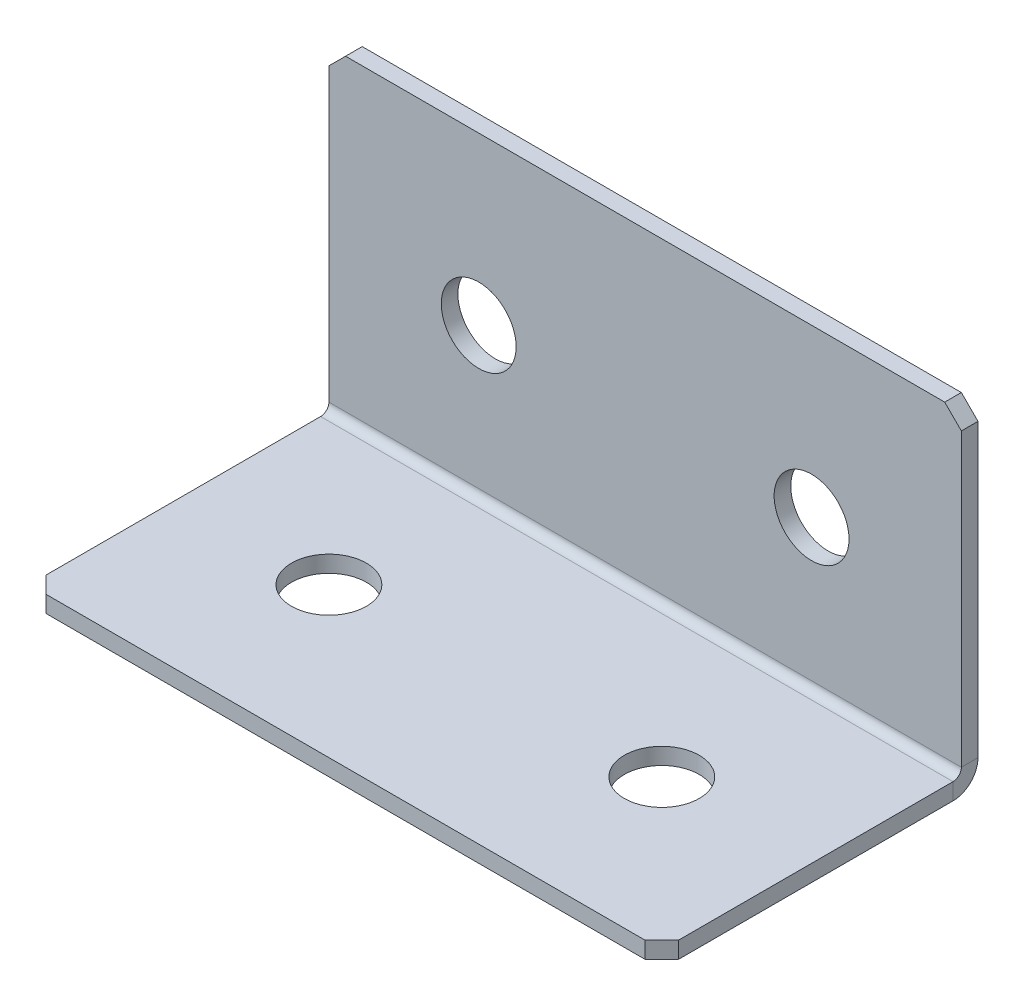
ISO-10303-21;
HEADER;
FILE_DESCRIPTION(('STEP AP214'),'2;1');
FILE_NAME('part.step','',(''),(''),'','','');
FILE_SCHEMA(('AUTOMOTIVE_DESIGN { 1 0 10303 214 1 1 1 1 }'));
ENDSEC;
DATA;
#1=APPLICATION_CONTEXT('core data for automotive mechanical design processes');
#2=APPLICATION_PROTOCOL_DEFINITION('international standard','automotive_design',2000,#1);
#3=PRODUCT_CONTEXT('',#1,'mechanical');
#4=PRODUCT('Part','Part','',(#3));
#5=PRODUCT_RELATED_PRODUCT_CATEGORY('part','',(#4));
#6=PRODUCT_DEFINITION_FORMATION('','',#4);
#7=PRODUCT_DEFINITION_CONTEXT('part definition',#1,'design');
#8=PRODUCT_DEFINITION('design','',#6,#7);
#9=PRODUCT_DEFINITION_SHAPE('','',#8);
#10=(LENGTH_UNIT() NAMED_UNIT(*) SI_UNIT(.MILLI.,.METRE.));
#11=(NAMED_UNIT(*) PLANE_ANGLE_UNIT() SI_UNIT($,.RADIAN.));
#12=(NAMED_UNIT(*) SI_UNIT($,.STERADIAN.) SOLID_ANGLE_UNIT());
#13=UNCERTAINTY_MEASURE_WITH_UNIT(LENGTH_MEASURE(1.E-05),#10,'distance_accuracy_value','');
#14=(GEOMETRIC_REPRESENTATION_CONTEXT(3) GLOBAL_UNCERTAINTY_ASSIGNED_CONTEXT((#13)) GLOBAL_UNIT_ASSIGNED_CONTEXT((#10,
#11,#12)) REPRESENTATION_CONTEXT('',''));
#15=CARTESIAN_POINT('',(0.,0.,0.));
#16=DIRECTION('',(0.,0.,1.));
#17=DIRECTION('',(1.,0.,0.));
#18=AXIS2_PLACEMENT_3D('',#15,#16,#17);
#19=CARTESIAN_POINT('',(0.,0.,2.));
#20=DIRECTION('',(0.,0.,-1.));
#21=DIRECTION('',(-1.,0.,0.));
#22=AXIS2_PLACEMENT_3D('',#19,#20,#21);
#23=PLANE('',#22);
#24=DIRECTION('',(0.,1.,0.));
#25=VECTOR('',#24,1.);
#26=CARTESIAN_POINT('',(38.,0.,2.));
#27=LINE('',#26,#25);
#28=CARTESIAN_POINT('',(38.,3.,2.));
#29=VERTEX_POINT('',#28);
#30=CARTESIAN_POINT('',(38.,38.,2.));
#31=VERTEX_POINT('',#30);
#32=EDGE_CURVE('E254',#29,#31,#27,.T.);
#33=ORIENTED_EDGE('',*,*,#32,.T.);
#34=DIRECTION('',(0.707106781186548,-0.707106781186548,0.));
#35=VECTOR('',#34,1.);
#36=CARTESIAN_POINT('',(38.,38.,2.));
#37=LINE('',#36,#35);
#38=CARTESIAN_POINT('',(36.,40.,2.));
#39=VERTEX_POINT('',#38);
#40=EDGE_CURVE('E303',#31,#39,#37,.F.);
#41=ORIENTED_EDGE('',*,*,#40,.T.);
#42=DIRECTION('',(-1.,0.,0.));
#43=VECTOR('',#42,1.);
#44=CARTESIAN_POINT('',(-38.,40.,2.));
#45=LINE('',#44,#43);
#46=CARTESIAN_POINT('',(-36.,40.,2.));
#47=VERTEX_POINT('',#46);
#48=EDGE_CURVE('E259',#39,#47,#45,.T.);
#49=ORIENTED_EDGE('',*,*,#48,.T.);
#50=DIRECTION('',(0.707106781186548,0.707106781186548,0.));
#51=VECTOR('',#50,1.);
#52=CARTESIAN_POINT('',(-36.,40.,2.));
#53=LINE('',#52,#51);
#54=CARTESIAN_POINT('',(-38.,38.,2.));
#55=VERTEX_POINT('',#54);
#56=EDGE_CURVE('E300',#47,#55,#53,.F.);
#57=ORIENTED_EDGE('',*,*,#56,.T.);
#58=DIRECTION('',(0.,-1.,0.));
#59=VECTOR('',#58,1.);
#60=CARTESIAN_POINT('',(-38.,0.,2.));
#61=LINE('',#60,#59);
#62=CARTESIAN_POINT('',(-38.,3.,2.));
#63=VERTEX_POINT('',#62);
#64=EDGE_CURVE('E251',#55,#63,#61,.T.);
#65=ORIENTED_EDGE('',*,*,#64,.T.);
#66=DIRECTION('',(1.,0.,0.));
#67=VECTOR('',#66,1.);
#68=CARTESIAN_POINT('',(38.,3.,2.));
#69=LINE('',#68,#67);
#70=EDGE_CURVE('E238',#29,#63,#69,.F.);
#71=ORIENTED_EDGE('',*,*,#70,.F.);
#72=EDGE_LOOP('',(#33,#41,#49,#57,#65,#71));
#73=FACE_BOUND('',#72,.T.);
#74=CARTESIAN_POINT('',(20.,19.9999999999999,2.));
#75=DIRECTION('',(0.,0.,1.));
#76=DIRECTION('',(1.,0.,0.));
#77=AXIS2_PLACEMENT_3D('',#74,#75,#76);
#78=CIRCLE('',#77,4.5);
#79=CARTESIAN_POINT('',(24.5,19.9999999999999,2.));
#80=VERTEX_POINT('',#79);
#81=EDGE_CURVE('E684',#80,#80,#78,.T.);
#82=ORIENTED_EDGE('',*,*,#81,.F.);
#83=EDGE_LOOP('',(#82));
#84=FACE_BOUND('',#83,.T.);
#85=CARTESIAN_POINT('',(-20.,19.9999999999999,2.));
#86=DIRECTION('',(0.,0.,1.));
#87=DIRECTION('',(1.,0.,0.));
#88=AXIS2_PLACEMENT_3D('',#85,#86,#87);
#89=CIRCLE('',#88,4.5);
#90=CARTESIAN_POINT('',(-15.5,19.9999999999999,2.));
#91=VERTEX_POINT('',#90);
#92=EDGE_CURVE('E666',#91,#91,#89,.T.);
#93=ORIENTED_EDGE('',*,*,#92,.F.);
#94=EDGE_LOOP('',(#93));
#95=FACE_BOUND('',#94,.T.);
#96=ADVANCED_FACE('F70',(#73,#84,#95),#23,.F.);
#97=CARTESIAN_POINT('',(38.,0.,2.));
#98=DIRECTION('',(-1.,0.,0.));
#99=DIRECTION('',(0.,1.,0.));
#100=AXIS2_PLACEMENT_3D('',#97,#98,#99);
#101=PLANE('',#100);
#102=DIRECTION('',(0.,1.,0.));
#103=VECTOR('',#102,1.);
#104=CARTESIAN_POINT('',(38.,0.,0.));
#105=LINE('',#104,#103);
#106=CARTESIAN_POINT('',(38.,3.,0.));
#107=VERTEX_POINT('',#106);
#108=CARTESIAN_POINT('',(38.,38.,0.));
#109=VERTEX_POINT('',#108);
#110=EDGE_CURVE('E266',#107,#109,#105,.T.);
#111=ORIENTED_EDGE('',*,*,#110,.T.);
#112=DIRECTION('',(0.,0.,-1.));
#113=VECTOR('',#112,1.);
#114=CARTESIAN_POINT('',(38.,38.,2.));
#115=LINE('',#114,#113);
#116=EDGE_CURVE('E296',#109,#31,#115,.F.);
#117=ORIENTED_EDGE('',*,*,#116,.T.);
#118=ORIENTED_EDGE('',*,*,#32,.F.);
#119=DIRECTION('',(0.,0.,-1.));
#120=VECTOR('',#119,1.);
#121=CARTESIAN_POINT('',(38.,3.,2.));
#122=LINE('',#121,#120);
#123=EDGE_CURVE('E233',#29,#107,#122,.T.);
#124=ORIENTED_EDGE('',*,*,#123,.T.);
#125=EDGE_LOOP('',(#111,#117,#118,#124));
#126=FACE_BOUND('',#125,.T.);
#127=ADVANCED_FACE('F324',(#126),#101,.F.);
#128=CARTESIAN_POINT('',(0.,0.,0.));
#129=DIRECTION('',(0.,0.,-1.));
#130=DIRECTION('',(-1.,0.,0.));
#131=AXIS2_PLACEMENT_3D('',#128,#129,#130);
#132=PLANE('',#131);
#133=CARTESIAN_POINT('',(-20.,19.9999999999999,0.));
#134=DIRECTION('',(0.,0.,-1.));
#135=DIRECTION('',(-1.,0.,0.));
#136=AXIS2_PLACEMENT_3D('',#133,#134,#135);
#137=CIRCLE('',#136,4.5);
#138=CARTESIAN_POINT('',(-24.5,19.9999999999999,0.));
#139=VERTEX_POINT('',#138);
#140=EDGE_CURVE('E675',#139,#139,#137,.T.);
#141=ORIENTED_EDGE('',*,*,#140,.F.);
#142=EDGE_LOOP('',(#141));
#143=FACE_BOUND('',#142,.T.);
#144=CARTESIAN_POINT('',(20.,19.9999999999999,0.));
#145=DIRECTION('',(0.,0.,-1.));
#146=DIRECTION('',(-1.,0.,0.));
#147=AXIS2_PLACEMENT_3D('',#144,#145,#146);
#148=CIRCLE('',#147,4.5);
#149=CARTESIAN_POINT('',(15.5,19.9999999999999,0.));
#150=VERTEX_POINT('',#149);
#151=EDGE_CURVE('E228',#150,#150,#148,.T.);
#152=ORIENTED_EDGE('',*,*,#151,.F.);
#153=EDGE_LOOP('',(#152));
#154=FACE_BOUND('',#153,.T.);
#155=DIRECTION('',(-1.,0.,0.));
#156=VECTOR('',#155,1.);
#157=CARTESIAN_POINT('',(0.,40.,0.));
#158=LINE('',#157,#156);
#159=CARTESIAN_POINT('',(36.,40.,0.));
#160=VERTEX_POINT('',#159);
#161=CARTESIAN_POINT('',(-36.,40.,0.));
#162=VERTEX_POINT('',#161);
#163=EDGE_CURVE('E255',#160,#162,#158,.T.);
#164=ORIENTED_EDGE('',*,*,#163,.F.);
#165=DIRECTION('',(-0.707106781186548,0.707106781186548,0.));
#166=VECTOR('',#165,1.);
#167=CARTESIAN_POINT('',(38.,38.,0.));
#168=LINE('',#167,#166);
#169=EDGE_CURVE('E80',#160,#109,#168,.F.);
#170=ORIENTED_EDGE('',*,*,#169,.T.);
#171=ORIENTED_EDGE('',*,*,#110,.F.);
#172=DIRECTION('',(1.,0.,0.));
#173=VECTOR('',#172,1.);
#174=CARTESIAN_POINT('',(38.,3.,0.));
#175=LINE('',#174,#173);
#176=CARTESIAN_POINT('',(-38.,3.00000000000001,0.));
#177=VERTEX_POINT('',#176);
#178=EDGE_CURVE('E169',#107,#177,#175,.F.);
#179=ORIENTED_EDGE('',*,*,#178,.T.);
#180=DIRECTION('',(0.,1.,0.));
#181=VECTOR('',#180,1.);
#182=CARTESIAN_POINT('',(-38.,0.,0.));
#183=LINE('',#182,#181);
#184=CARTESIAN_POINT('',(-38.,38.,0.));
#185=VERTEX_POINT('',#184);
#186=EDGE_CURVE('E248',#185,#177,#183,.F.);
#187=ORIENTED_EDGE('',*,*,#186,.F.);
#188=DIRECTION('',(-0.707106781186548,-0.707106781186548,0.));
#189=VECTOR('',#188,1.);
#190=CARTESIAN_POINT('',(-38.,38.,0.));
#191=LINE('',#190,#189);
#192=EDGE_CURVE('E92',#185,#162,#191,.F.);
#193=ORIENTED_EDGE('',*,*,#192,.T.);
#194=EDGE_LOOP('',(#164,#170,#171,#179,#187,#193));
#195=FACE_BOUND('',#194,.T.);
#196=ADVANCED_FACE('F319',(#143,#154,#195),#132,.T.);
#197=CARTESIAN_POINT('',(-38.,40.,2.));
#198=DIRECTION('',(0.,-1.,0.));
#199=DIRECTION('',(-1.,0.,0.));
#200=AXIS2_PLACEMENT_3D('',#197,#198,#199);
#201=PLANE('',#200);
#202=ORIENTED_EDGE('',*,*,#48,.F.);
#203=DIRECTION('',(0.,0.,1.));
#204=VECTOR('',#203,1.);
#205=CARTESIAN_POINT('',(36.,40.,2.));
#206=LINE('',#205,#204);
#207=EDGE_CURVE('E310',#39,#160,#206,.F.);
#208=ORIENTED_EDGE('',*,*,#207,.T.);
#209=ORIENTED_EDGE('',*,*,#163,.T.);
#210=DIRECTION('',(0.,0.,-1.));
#211=VECTOR('',#210,1.);
#212=CARTESIAN_POINT('',(-36.,40.,2.));
#213=LINE('',#212,#211);
#214=EDGE_CURVE('E306',#162,#47,#213,.F.);
#215=ORIENTED_EDGE('',*,*,#214,.T.);
#216=EDGE_LOOP('',(#202,#208,#209,#215));
#217=FACE_BOUND('',#216,.T.);
#218=ADVANCED_FACE('F332',(#217),#201,.F.);
#219=CARTESIAN_POINT('',(-38.,0.,2.));
#220=DIRECTION('',(1.,0.,0.));
#221=DIRECTION('',(0.,-1.,0.));
#222=AXIS2_PLACEMENT_3D('',#219,#220,#221);
#223=PLANE('',#222);
#224=ORIENTED_EDGE('',*,*,#64,.F.);
#225=DIRECTION('',(0.,0.,1.));
#226=VECTOR('',#225,1.);
#227=CARTESIAN_POINT('',(-38.,38.,2.));
#228=LINE('',#227,#226);
#229=EDGE_CURVE('E13',#55,#185,#228,.F.);
#230=ORIENTED_EDGE('',*,*,#229,.T.);
#231=ORIENTED_EDGE('',*,*,#186,.T.);
#232=DIRECTION('',(0.,0.,-1.));
#233=VECTOR('',#232,1.);
#234=CARTESIAN_POINT('',(-38.,3.,2.));
#235=LINE('',#234,#233);
#236=EDGE_CURVE('E244',#63,#177,#235,.T.);
#237=ORIENTED_EDGE('',*,*,#236,.F.);
#238=EDGE_LOOP('',(#224,#230,#231,#237));
#239=FACE_BOUND('',#238,.T.);
#240=ADVANCED_FACE('F336',(#239),#223,.F.);
#241=CARTESIAN_POINT('',(-38.,3.,3.));
#242=DIRECTION('',(-1.,0.,0.));
#243=DIRECTION('',(0.,0.,1.));
#244=AXIS2_PLACEMENT_3D('',#241,#242,#243);
#245=PLANE('',#244);
#246=DIRECTION('',(0.,1.,0.));
#247=VECTOR('',#246,1.);
#248=CARTESIAN_POINT('',(-38.,0.,2.99999999999999));
#249=LINE('',#248,#247);
#250=CARTESIAN_POINT('',(-38.,2.,3.));
#251=VERTEX_POINT('',#250);
#252=CARTESIAN_POINT('',(-38.,0.,2.99999999999999));
#253=VERTEX_POINT('',#252);
#254=EDGE_CURVE('E224',#251,#253,#249,.F.);
#255=ORIENTED_EDGE('',*,*,#254,.F.);
#256=CARTESIAN_POINT('',(-38.,3.,3.));
#257=DIRECTION('',(1.,0.,0.));
#258=DIRECTION('',(0.,0.,-1.));
#259=AXIS2_PLACEMENT_3D('',#256,#257,#258);
#260=CIRCLE('',#259,1.);
#261=EDGE_CURVE('E173',#63,#251,#260,.F.);
#262=ORIENTED_EDGE('',*,*,#261,.F.);
#263=ORIENTED_EDGE('',*,*,#236,.T.);
#264=CARTESIAN_POINT('',(-38.,3.,3.));
#265=DIRECTION('',(1.,0.,0.));
#266=DIRECTION('',(0.,0.,-1.));
#267=AXIS2_PLACEMENT_3D('',#264,#265,#266);
#268=CIRCLE('',#267,3.);
#269=EDGE_CURVE('E231',#177,#253,#268,.F.);
#270=ORIENTED_EDGE('',*,*,#269,.T.);
#271=EDGE_LOOP('',(#255,#262,#263,#270));
#272=FACE_BOUND('',#271,.T.);
#273=ADVANCED_FACE('F340',(#272),#245,.T.);
#274=CARTESIAN_POINT('',(38.,3.,3.));
#275=DIRECTION('',(-1.,0.,0.));
#276=DIRECTION('',(0.,0.,1.));
#277=AXIS2_PLACEMENT_3D('',#274,#275,#276);
#278=PLANE('',#277);
#279=CARTESIAN_POINT('',(38.,3.,3.));
#280=DIRECTION('',(1.,0.,0.));
#281=DIRECTION('',(0.,0.,-1.));
#282=AXIS2_PLACEMENT_3D('',#279,#280,#281);
#283=CIRCLE('',#282,1.);
#284=CARTESIAN_POINT('',(38.,2.,3.));
#285=VERTEX_POINT('',#284);
#286=EDGE_CURVE('E180',#285,#29,#283,.T.);
#287=ORIENTED_EDGE('',*,*,#286,.F.);
#288=DIRECTION('',(0.,1.,0.));
#289=VECTOR('',#288,1.);
#290=CARTESIAN_POINT('',(38.,2.,3.));
#291=LINE('',#290,#289);
#292=CARTESIAN_POINT('',(38.,0.,2.99999999999999));
#293=VERTEX_POINT('',#292);
#294=EDGE_CURVE('E177',#285,#293,#291,.F.);
#295=ORIENTED_EDGE('',*,*,#294,.T.);
#296=CARTESIAN_POINT('',(38.,3.,3.));
#297=DIRECTION('',(1.,0.,0.));
#298=DIRECTION('',(0.,0.,-1.));
#299=AXIS2_PLACEMENT_3D('',#296,#297,#298);
#300=CIRCLE('',#299,3.);
#301=EDGE_CURVE('E161',#293,#107,#300,.T.);
#302=ORIENTED_EDGE('',*,*,#301,.T.);
#303=ORIENTED_EDGE('',*,*,#123,.F.);
#304=EDGE_LOOP('',(#287,#295,#302,#303));
#305=FACE_BOUND('',#304,.T.);
#306=ADVANCED_FACE('F178',(#305),#278,.F.);
#307=CARTESIAN_POINT('',(38.,3.,3.));
#308=DIRECTION('',(1.,0.,0.));
#309=DIRECTION('',(0.,-1.,0.));
#310=AXIS2_PLACEMENT_3D('',#307,#308,#309);
#311=CYLINDRICAL_SURFACE('',#310,3.);
#312=ORIENTED_EDGE('',*,*,#178,.F.);
#313=ORIENTED_EDGE('',*,*,#301,.F.);
#314=DIRECTION('',(1.,0.,0.));
#315=VECTOR('',#314,1.);
#316=CARTESIAN_POINT('',(-38.,0.,2.99999999999999));
#317=LINE('',#316,#315);
#318=EDGE_CURVE('E166',#293,#253,#317,.F.);
#319=ORIENTED_EDGE('',*,*,#318,.T.);
#320=ORIENTED_EDGE('',*,*,#269,.F.);
#321=EDGE_LOOP('',(#312,#313,#319,#320));
#322=FACE_BOUND('',#321,.T.);
#323=ADVANCED_FACE('F163',(#322),#311,.T.);
#324=CARTESIAN_POINT('',(38.,3.,3.));
#325=DIRECTION('',(1.,0.,0.));
#326=DIRECTION('',(0.,-1.,0.));
#327=AXIS2_PLACEMENT_3D('',#324,#325,#326);
#328=CYLINDRICAL_SURFACE('',#327,1.);
#329=ORIENTED_EDGE('',*,*,#70,.T.);
#330=ORIENTED_EDGE('',*,*,#261,.T.);
#331=DIRECTION('',(1.,0.,0.));
#332=VECTOR('',#331,1.);
#333=CARTESIAN_POINT('',(-38.,2.,3.));
#334=LINE('',#333,#332);
#335=EDGE_CURVE('E186',#251,#285,#334,.T.);
#336=ORIENTED_EDGE('',*,*,#335,.T.);
#337=ORIENTED_EDGE('',*,*,#286,.T.);
#338=EDGE_LOOP('',(#329,#330,#336,#337));
#339=FACE_BOUND('',#338,.T.);
#340=ADVANCED_FACE('F343',(#339),#328,.F.);
#341=CARTESIAN_POINT('',(-38.,0.,1.99999999999999));
#342=DIRECTION('',(1.,0.,0.));
#343=DIRECTION('',(0.,0.,-1.));
#344=AXIS2_PLACEMENT_3D('',#341,#342,#343);
#345=PLANE('',#344);
#346=DIRECTION('',(0.,0.,-1.));
#347=VECTOR('',#346,1.);
#348=CARTESIAN_POINT('',(-38.,0.,0.));
#349=LINE('',#348,#347);
#350=CARTESIAN_POINT('',(-38.,-1.18754434294446E-13,36.));
#351=VERTEX_POINT('',#350);
#352=EDGE_CURVE('E194',#351,#253,#349,.T.);
#353=ORIENTED_EDGE('',*,*,#352,.F.);
#354=DIRECTION('',(0.,1.,0.));
#355=VECTOR('',#354,1.);
#356=CARTESIAN_POINT('',(-38.,-1.18710365520667E-13,36.));
#357=LINE('',#356,#355);
#358=CARTESIAN_POINT('',(-38.,1.99999999999988,36.));
#359=VERTEX_POINT('',#358);
#360=EDGE_CURVE('E292',#351,#359,#357,.T.);
#361=ORIENTED_EDGE('',*,*,#360,.T.);
#362=DIRECTION('',(0.,0.,1.));
#363=VECTOR('',#362,1.);
#364=CARTESIAN_POINT('',(-38.,2.,2.));
#365=LINE('',#364,#363);
#366=EDGE_CURVE('E196',#359,#251,#365,.F.);
#367=ORIENTED_EDGE('',*,*,#366,.T.);
#368=ORIENTED_EDGE('',*,*,#254,.T.);
#369=EDGE_LOOP('',(#353,#361,#367,#368));
#370=FACE_BOUND('',#369,.T.);
#371=ADVANCED_FACE('F360',(#370),#345,.F.);
#372=CARTESIAN_POINT('',(38.,-1.25767452008319E-13,38.));
#373=DIRECTION('',(-1.,0.,0.));
#374=DIRECTION('',(0.,0.,1.));
#375=AXIS2_PLACEMENT_3D('',#372,#373,#374);
#376=PLANE('',#375);
#377=DIRECTION('',(0.,0.,-1.));
#378=VECTOR('',#377,1.);
#379=CARTESIAN_POINT('',(38.,1.99999999999987,38.));
#380=LINE('',#379,#378);
#381=CARTESIAN_POINT('',(38.,1.99999999999988,36.));
#382=VERTEX_POINT('',#381);
#383=EDGE_CURVE('E217',#285,#382,#380,.F.);
#384=ORIENTED_EDGE('',*,*,#383,.T.);
#385=DIRECTION('',(0.,-1.,0.));
#386=VECTOR('',#385,1.);
#387=CARTESIAN_POINT('',(38.,-1.18784489330632E-13,36.));
#388=LINE('',#387,#386);
#389=CARTESIAN_POINT('',(38.,-1.18754434294446E-13,36.));
#390=VERTEX_POINT('',#389);
#391=EDGE_CURVE('E200',#382,#390,#388,.T.);
#392=ORIENTED_EDGE('',*,*,#391,.T.);
#393=DIRECTION('',(0.,0.,1.));
#394=VECTOR('',#393,1.);
#395=CARTESIAN_POINT('',(38.,0.,0.));
#396=LINE('',#395,#394);
#397=EDGE_CURVE('E191',#293,#390,#396,.T.);
#398=ORIENTED_EDGE('',*,*,#397,.F.);
#399=ORIENTED_EDGE('',*,*,#294,.F.);
#400=EDGE_LOOP('',(#384,#392,#398,#399));
#401=FACE_BOUND('',#400,.T.);
#402=ADVANCED_FACE('F198',(#401),#376,.F.);
#403=CARTESIAN_POINT('',(0.,0.,0.));
#404=DIRECTION('',(0.,1.,0.));
#405=DIRECTION('',(0.,0.,1.));
#406=AXIS2_PLACEMENT_3D('',#403,#404,#405);
#407=PLANE('',#406);
#408=CARTESIAN_POINT('',(-20.,0.,20.));
#409=DIRECTION('',(0.,1.,0.));
#410=DIRECTION('',(0.,0.,1.));
#411=AXIS2_PLACEMENT_3D('',#408,#409,#410);
#412=CIRCLE('',#411,4.5);
#413=CARTESIAN_POINT('',(-20.,0.,24.5));
#414=VERTEX_POINT('',#413);
#415=EDGE_CURVE('E661',#414,#414,#412,.T.);
#416=ORIENTED_EDGE('',*,*,#415,.T.);
#417=EDGE_LOOP('',(#416));
#418=FACE_BOUND('',#417,.T.);
#419=CARTESIAN_POINT('',(20.,0.,20.));
#420=DIRECTION('',(0.,1.,0.));
#421=DIRECTION('',(0.,0.,1.));
#422=AXIS2_PLACEMENT_3D('',#419,#420,#421);
#423=CIRCLE('',#422,4.5);
#424=CARTESIAN_POINT('',(20.,0.,24.5));
#425=VERTEX_POINT('',#424);
#426=EDGE_CURVE('E664',#425,#425,#423,.T.);
#427=ORIENTED_EDGE('',*,*,#426,.T.);
#428=EDGE_LOOP('',(#427));
#429=FACE_BOUND('',#428,.T.);
#430=ORIENTED_EDGE('',*,*,#397,.T.);
#431=DIRECTION('',(0.707106781186546,0.,-0.707106781186549));
#432=VECTOR('',#431,1.);
#433=CARTESIAN_POINT('',(36.,-1.25767452008319E-13,38.));
#434=LINE('',#433,#432);
#435=CARTESIAN_POINT('',(36.,-1.25737396972132E-13,38.));
#436=VERTEX_POINT('',#435);
#437=EDGE_CURVE('E289',#390,#436,#434,.F.);
#438=ORIENTED_EDGE('',*,*,#437,.T.);
#439=DIRECTION('',(-1.,0.,0.));
#440=VECTOR('',#439,1.);
#441=CARTESIAN_POINT('',(0.,-1.25737396972132E-13,38.));
#442=LINE('',#441,#440);
#443=CARTESIAN_POINT('',(-36.,-1.25737396972132E-13,38.));
#444=VERTEX_POINT('',#443);
#445=EDGE_CURVE('E202',#436,#444,#442,.T.);
#446=ORIENTED_EDGE('',*,*,#445,.T.);
#447=DIRECTION('',(0.707106781186549,0.,0.707106781186546));
#448=VECTOR('',#447,1.);
#449=CARTESIAN_POINT('',(-38.,-1.18710365520667E-13,36.));
#450=LINE('',#449,#448);
#451=EDGE_CURVE('E286',#444,#351,#450,.F.);
#452=ORIENTED_EDGE('',*,*,#451,.T.);
#453=ORIENTED_EDGE('',*,*,#352,.T.);
#454=ORIENTED_EDGE('',*,*,#318,.F.);
#455=EDGE_LOOP('',(#430,#438,#446,#452,#453,#454));
#456=FACE_BOUND('',#455,.T.);
#457=ADVANCED_FACE('F190',(#418,#429,#456),#407,.F.);
#458=CARTESIAN_POINT('',(0.,2.00000000000001,0.));
#459=DIRECTION('',(0.,1.,0.));
#460=DIRECTION('',(0.,0.,1.));
#461=AXIS2_PLACEMENT_3D('',#458,#459,#460);
#462=PLANE('',#461);
#463=CARTESIAN_POINT('',(-20.,1.99999999999994,20.));
#464=DIRECTION('',(0.,1.,0.));
#465=DIRECTION('',(0.,0.,1.));
#466=AXIS2_PLACEMENT_3D('',#463,#464,#465);
#467=CIRCLE('',#466,4.5);
#468=CARTESIAN_POINT('',(-20.,1.99999999999992,24.5));
#469=VERTEX_POINT('',#468);
#470=EDGE_CURVE('E758',#469,#469,#467,.T.);
#471=ORIENTED_EDGE('',*,*,#470,.F.);
#472=EDGE_LOOP('',(#471));
#473=FACE_BOUND('',#472,.T.);
#474=CARTESIAN_POINT('',(20.,1.99999999999994,20.));
#475=DIRECTION('',(0.,1.,0.));
#476=DIRECTION('',(0.,0.,1.));
#477=AXIS2_PLACEMENT_3D('',#474,#475,#476);
#478=CIRCLE('',#477,4.5);
#479=CARTESIAN_POINT('',(20.,1.99999999999992,24.5));
#480=VERTEX_POINT('',#479);
#481=EDGE_CURVE('E667',#480,#480,#478,.T.);
#482=ORIENTED_EDGE('',*,*,#481,.F.);
#483=EDGE_LOOP('',(#482));
#484=FACE_BOUND('',#483,.T.);
#485=DIRECTION('',(1.,0.,0.));
#486=VECTOR('',#485,1.);
#487=CARTESIAN_POINT('',(-38.,1.99999999999987,38.));
#488=LINE('',#487,#486);
#489=CARTESIAN_POINT('',(36.,1.99999999999987,38.));
#490=VERTEX_POINT('',#489);
#491=CARTESIAN_POINT('',(-36.,1.99999999999987,38.));
#492=VERTEX_POINT('',#491);
#493=EDGE_CURVE('E210',#490,#492,#488,.F.);
#494=ORIENTED_EDGE('',*,*,#493,.F.);
#495=DIRECTION('',(-0.707106781186546,0.,0.707106781186549));
#496=VECTOR('',#495,1.);
#497=CARTESIAN_POINT('',(37.,1.99999999999988,36.9999999999999));
#498=LINE('',#497,#496);
#499=EDGE_CURVE('E281',#490,#382,#498,.F.);
#500=ORIENTED_EDGE('',*,*,#499,.T.);
#501=ORIENTED_EDGE('',*,*,#383,.F.);
#502=ORIENTED_EDGE('',*,*,#335,.F.);
#503=ORIENTED_EDGE('',*,*,#366,.F.);
#504=DIRECTION('',(-0.707106781186549,0.,-0.707106781186546));
#505=VECTOR('',#504,1.);
#506=CARTESIAN_POINT('',(-36.9999999999999,1.99999999999988,37.0000000000001));
#507=LINE('',#506,#505);
#508=EDGE_CURVE('E278',#359,#492,#507,.F.);
#509=ORIENTED_EDGE('',*,*,#508,.T.);
#510=EDGE_LOOP('',(#494,#500,#501,#502,#503,#509));
#511=FACE_BOUND('',#510,.T.);
#512=ADVANCED_FACE('F347',(#473,#484,#511),#462,.T.);
#513=CARTESIAN_POINT('',(-38.,-1.25767452008319E-13,38.));
#514=DIRECTION('',(0.,0.,-1.));
#515=DIRECTION('',(0.,1.,0.));
#516=AXIS2_PLACEMENT_3D('',#513,#514,#515);
#517=PLANE('',#516);
#518=ORIENTED_EDGE('',*,*,#445,.F.);
#519=DIRECTION('',(0.,1.,0.));
#520=VECTOR('',#519,1.);
#521=CARTESIAN_POINT('',(36.,-1.25767452008319E-13,38.));
#522=LINE('',#521,#520);
#523=EDGE_CURVE('E274',#436,#490,#522,.T.);
#524=ORIENTED_EDGE('',*,*,#523,.T.);
#525=ORIENTED_EDGE('',*,*,#493,.T.);
#526=DIRECTION('',(0.,-1.,0.));
#527=VECTOR('',#526,1.);
#528=CARTESIAN_POINT('',(-36.,-1.25767452008319E-13,38.));
#529=LINE('',#528,#527);
#530=EDGE_CURVE('E263',#492,#444,#529,.T.);
#531=ORIENTED_EDGE('',*,*,#530,.T.);
#532=EDGE_LOOP('',(#518,#524,#525,#531));
#533=FACE_BOUND('',#532,.T.);
#534=ADVANCED_FACE('F354',(#533),#517,.F.);
#535=CARTESIAN_POINT('',(20.,19.9999999999999,2.));
#536=DIRECTION('',(0.,0.,1.));
#537=DIRECTION('',(1.,0.,0.));
#538=AXIS2_PLACEMENT_3D('',#535,#536,#537);
#539=CYLINDRICAL_SURFACE('',#538,4.5);
#540=ORIENTED_EDGE('',*,*,#81,.T.);
#541=EDGE_LOOP('',(#540));
#542=FACE_BOUND('',#541,.T.);
#543=ORIENTED_EDGE('',*,*,#151,.T.);
#544=EDGE_LOOP('',(#543));
#545=FACE_BOUND('',#544,.T.);
#546=ADVANCED_FACE('F444',(#542,#545),#539,.F.);
#547=CARTESIAN_POINT('',(-20.,19.9999999999999,2.));
#548=DIRECTION('',(0.,0.,1.));
#549=DIRECTION('',(1.,0.,0.));
#550=AXIS2_PLACEMENT_3D('',#547,#548,#549);
#551=CYLINDRICAL_SURFACE('',#550,4.5);
#552=ORIENTED_EDGE('',*,*,#92,.T.);
#553=EDGE_LOOP('',(#552));
#554=FACE_BOUND('',#553,.T.);
#555=ORIENTED_EDGE('',*,*,#140,.T.);
#556=EDGE_LOOP('',(#555));
#557=FACE_BOUND('',#556,.T.);
#558=ADVANCED_FACE('F435',(#554,#557),#551,.F.);
#559=CARTESIAN_POINT('',(20.,1.99999999999994,20.));
#560=DIRECTION('',(0.,1.,0.));
#561=DIRECTION('',(0.,0.,1.));
#562=AXIS2_PLACEMENT_3D('',#559,#560,#561);
#563=CYLINDRICAL_SURFACE('',#562,4.5);
#564=ORIENTED_EDGE('',*,*,#426,.F.);
#565=EDGE_LOOP('',(#564));
#566=FACE_BOUND('',#565,.T.);
#567=ORIENTED_EDGE('',*,*,#481,.T.);
#568=EDGE_LOOP('',(#567));
#569=FACE_BOUND('',#568,.T.);
#570=ADVANCED_FACE('F426',(#566,#569),#563,.F.);
#571=CARTESIAN_POINT('',(-20.,1.99999999999994,20.));
#572=DIRECTION('',(0.,1.,0.));
#573=DIRECTION('',(0.,0.,1.));
#574=AXIS2_PLACEMENT_3D('',#571,#572,#573);
#575=CYLINDRICAL_SURFACE('',#574,4.5);
#576=ORIENTED_EDGE('',*,*,#415,.F.);
#577=EDGE_LOOP('',(#576));
#578=FACE_BOUND('',#577,.T.);
#579=ORIENTED_EDGE('',*,*,#470,.T.);
#580=EDGE_LOOP('',(#579));
#581=FACE_BOUND('',#580,.T.);
#582=ADVANCED_FACE('F392',(#578,#581),#575,.F.);
#583=CARTESIAN_POINT('',(36.,-1.25767452008319E-13,38.));
#584=DIRECTION('',(-0.707106781186549,0.,-0.707106781186546));
#585=DIRECTION('',(0.,1.,0.));
#586=AXIS2_PLACEMENT_3D('',#583,#584,#585);
#587=PLANE('',#586);
#588=ORIENTED_EDGE('',*,*,#437,.F.);
#589=ORIENTED_EDGE('',*,*,#391,.F.);
#590=ORIENTED_EDGE('',*,*,#499,.F.);
#591=ORIENTED_EDGE('',*,*,#523,.F.);
#592=EDGE_LOOP('',(#588,#589,#590,#591));
#593=FACE_BOUND('',#592,.T.);
#594=ADVANCED_FACE('F349',(#593),#587,.F.);
#595=CARTESIAN_POINT('',(-38.,-1.18710365520667E-13,36.));
#596=DIRECTION('',(0.707106781186546,0.,-0.707106781186549));
#597=DIRECTION('',(0.,1.,0.));
#598=AXIS2_PLACEMENT_3D('',#595,#596,#597);
#599=PLANE('',#598);
#600=ORIENTED_EDGE('',*,*,#451,.F.);
#601=ORIENTED_EDGE('',*,*,#530,.F.);
#602=ORIENTED_EDGE('',*,*,#508,.F.);
#603=ORIENTED_EDGE('',*,*,#360,.F.);
#604=EDGE_LOOP('',(#600,#601,#602,#603));
#605=FACE_BOUND('',#604,.T.);
#606=ADVANCED_FACE('F357',(#605),#599,.F.);
#607=CARTESIAN_POINT('',(38.,38.,2.));
#608=DIRECTION('',(-0.707106781186547,-0.707106781186547,0.));
#609=DIRECTION('',(0.,0.,1.));
#610=AXIS2_PLACEMENT_3D('',#607,#608,#609);
#611=PLANE('',#610);
#612=ORIENTED_EDGE('',*,*,#169,.F.);
#613=ORIENTED_EDGE('',*,*,#207,.F.);
#614=ORIENTED_EDGE('',*,*,#40,.F.);
#615=ORIENTED_EDGE('',*,*,#116,.F.);
#616=EDGE_LOOP('',(#612,#613,#614,#615));
#617=FACE_BOUND('',#616,.T.);
#618=ADVANCED_FACE('F326',(#617),#611,.F.);
#619=CARTESIAN_POINT('',(-36.,40.,2.));
#620=DIRECTION('',(0.707106781186547,-0.707106781186547,0.));
#621=DIRECTION('',(0.,0.,1.));
#622=AXIS2_PLACEMENT_3D('',#619,#620,#621);
#623=PLANE('',#622);
#624=ORIENTED_EDGE('',*,*,#192,.F.);
#625=ORIENTED_EDGE('',*,*,#229,.F.);
#626=ORIENTED_EDGE('',*,*,#56,.F.);
#627=ORIENTED_EDGE('',*,*,#214,.F.);
#628=EDGE_LOOP('',(#624,#625,#626,#627));
#629=FACE_BOUND('',#628,.T.);
#630=ADVANCED_FACE('F73',(#629),#623,.F.);
#631=CLOSED_SHELL('',(#96,#127,#196,#218,#240,#273,#306,#323,#340,#371,#402,#457,#512,#534,#546,
#558,#570,#582,#594,#606,#618,#630));
#632=MANIFOLD_SOLID_BREP('B2',#631);
#633=ADVANCED_BREP_SHAPE_REPRESENTATION('',(#18,#632),#14);
#634=SHAPE_DEFINITION_REPRESENTATION(#9,#633);
ENDSEC;
END-ISO-10303-21;
